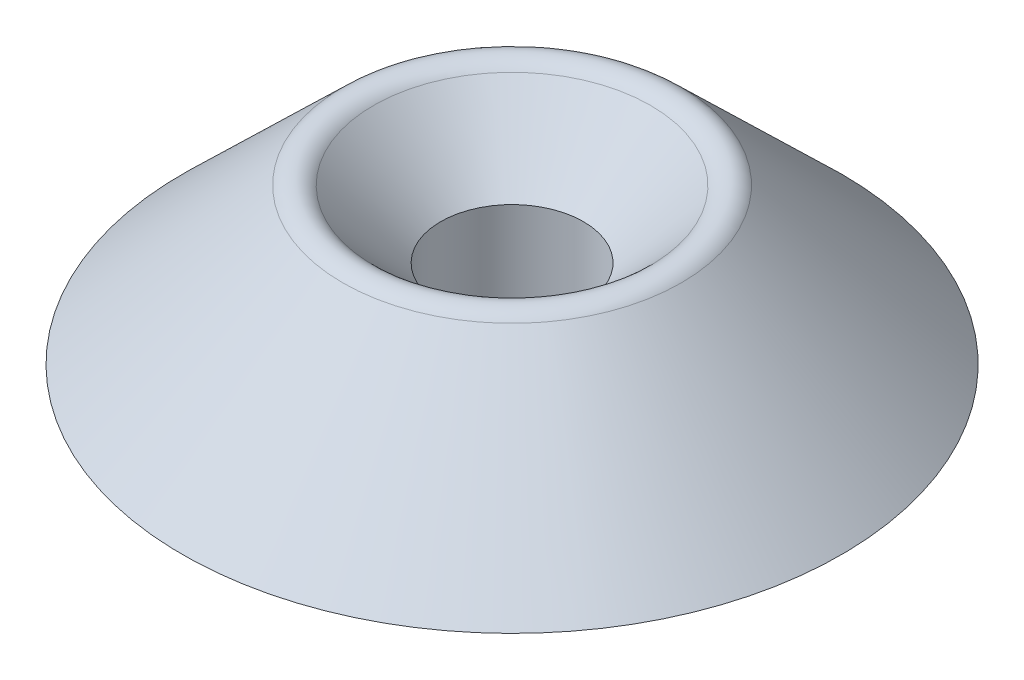
ISO-10303-21;
HEADER;
FILE_DESCRIPTION(('STEP AP214'),'2;1');
FILE_NAME('part.step','',(''),(''),'','','');
FILE_SCHEMA(('AUTOMOTIVE_DESIGN { 1 0 10303 214 1 1 1 1 }'));
ENDSEC;
DATA;
#1=APPLICATION_CONTEXT('core data for automotive mechanical design processes');
#2=APPLICATION_PROTOCOL_DEFINITION('international standard','automotive_design',2000,#1);
#3=PRODUCT_CONTEXT('',#1,'mechanical');
#4=PRODUCT('Part','Part','',(#3));
#5=PRODUCT_RELATED_PRODUCT_CATEGORY('part','',(#4));
#6=PRODUCT_DEFINITION_FORMATION('','',#4);
#7=PRODUCT_DEFINITION_CONTEXT('part definition',#1,'design');
#8=PRODUCT_DEFINITION('design','',#6,#7);
#9=PRODUCT_DEFINITION_SHAPE('','',#8);
#10=(LENGTH_UNIT() NAMED_UNIT(*) SI_UNIT(.MILLI.,.METRE.));
#11=(NAMED_UNIT(*) PLANE_ANGLE_UNIT() SI_UNIT($,.RADIAN.));
#12=(NAMED_UNIT(*) SI_UNIT($,.STERADIAN.) SOLID_ANGLE_UNIT());
#13=UNCERTAINTY_MEASURE_WITH_UNIT(LENGTH_MEASURE(1.E-05),#10,'distance_accuracy_value','');
#14=(GEOMETRIC_REPRESENTATION_CONTEXT(3) GLOBAL_UNCERTAINTY_ASSIGNED_CONTEXT((#13)) GLOBAL_UNIT_ASSIGNED_CONTEXT((#10,
#11,#12)) REPRESENTATION_CONTEXT('',''));
#15=CARTESIAN_POINT('',(0.,0.,0.));
#16=DIRECTION('',(0.,0.,1.));
#17=DIRECTION('',(1.,0.,0.));
#18=AXIS2_PLACEMENT_3D('',#15,#16,#17);
#19=CARTESIAN_POINT('',(0.,0.,0.));
#20=DIRECTION('',(0.,-1.,0.));
#21=DIRECTION('',(0.,0.,-1.));
#22=AXIS2_PLACEMENT_3D('',#19,#20,#21);
#23=CYLINDRICAL_SURFACE('',#22,3.25);
#24=CARTESIAN_POINT('',(0.,0.,0.));
#25=DIRECTION('',(0.,-1.,0.));
#26=DIRECTION('',(0.,0.,-1.));
#27=AXIS2_PLACEMENT_3D('',#24,#25,#26);
#28=CIRCLE('',#27,3.25);
#29=CARTESIAN_POINT('',(0.,0.,-3.25));
#30=VERTEX_POINT('',#29);
#31=EDGE_CURVE('E48',#30,#30,#28,.T.);
#32=ORIENTED_EDGE('',*,*,#31,.T.);
#33=EDGE_LOOP('',(#32));
#34=FACE_BOUND('',#33,.T.);
#35=CARTESIAN_POINT('',(0.,4.,0.));
#36=DIRECTION('',(0.,-1.,0.));
#37=DIRECTION('',(0.,0.,-1.));
#38=AXIS2_PLACEMENT_3D('',#35,#36,#37);
#39=CIRCLE('',#38,3.25);
#40=CARTESIAN_POINT('',(0.,4.,-3.25));
#41=VERTEX_POINT('',#40);
#42=EDGE_CURVE('E57',#41,#41,#39,.T.);
#43=ORIENTED_EDGE('',*,*,#42,.F.);
#44=EDGE_LOOP('',(#43));
#45=FACE_BOUND('',#44,.T.);
#46=ADVANCED_FACE('F37',(#34,#45),#23,.F.);
#47=CARTESIAN_POINT('',(3.25,0.,0.));
#48=DIRECTION('',(0.,-1.,0.));
#49=DIRECTION('',(0.,0.,-1.));
#50=AXIS2_PLACEMENT_3D('',#47,#48,#49);
#51=PLANE('',#50);
#52=CARTESIAN_POINT('',(0.,0.,0.));
#53=DIRECTION('',(0.,-1.,0.));
#54=DIRECTION('',(0.,0.,-1.));
#55=AXIS2_PLACEMENT_3D('',#52,#53,#54);
#56=CIRCLE('',#55,15.);
#57=CARTESIAN_POINT('',(0.,0.,-15.));
#58=VERTEX_POINT('',#57);
#59=EDGE_CURVE('E52',#58,#58,#56,.T.);
#60=ORIENTED_EDGE('',*,*,#59,.T.);
#61=EDGE_LOOP('',(#60));
#62=FACE_BOUND('',#61,.T.);
#63=ORIENTED_EDGE('',*,*,#31,.F.);
#64=EDGE_LOOP('',(#63));
#65=FACE_BOUND('',#64,.T.);
#66=ADVANCED_FACE('F64',(#62,#65),#51,.T.);
#67=CARTESIAN_POINT('',(0.,0.,0.));
#68=DIRECTION('',(0.,-1.,0.));
#69=DIRECTION('',(0.,0.,-1.));
#70=AXIS2_PLACEMENT_3D('',#67,#68,#69);
#71=CONICAL_SURFACE('',#70,15.,0.801269846389239);
#72=CARTESIAN_POINT('',(0.,7.06516150448033,0.));
#73=DIRECTION('',(0.,1.,0.));
#74=DIRECTION('',(0.,0.,1.));
#75=AXIS2_PLACEMENT_3D('',#72,#73,#74);
#76=CIRCLE('',#75,7.70693005989127);
#77=CARTESIAN_POINT('',(0.,7.06516150448033,7.70693005989127));
#78=VERTEX_POINT('',#77);
#79=EDGE_CURVE('E44',#78,#78,#76,.F.);
#80=ORIENTED_EDGE('',*,*,#79,.T.);
#81=EDGE_LOOP('',(#80));
#82=FACE_BOUND('',#81,.T.);
#83=ORIENTED_EDGE('',*,*,#59,.F.);
#84=EDGE_LOOP('',(#83));
#85=FACE_BOUND('',#84,.T.);
#86=ADVANCED_FACE('F69',(#82,#85),#71,.T.);
#87=CARTESIAN_POINT('',(0.,7.74999999999999,0.));
#88=DIRECTION('',(0.,1.,0.));
#89=DIRECTION('',(0.,0.,1.));
#90=AXIS2_PLACEMENT_3D('',#87,#88,#89);
#91=CONICAL_SURFACE('',#90,7.,0.78539816339745);
#92=CARTESIAN_POINT('',(0.,7.0540280628777,0.));
#93=DIRECTION('',(0.,-1.,0.));
#94=DIRECTION('',(0.,0.,-1.));
#95=AXIS2_PLACEMENT_3D('',#92,#93,#94);
#96=CIRCLE('',#95,6.30402806287771);
#97=CARTESIAN_POINT('',(0.,7.0540280628777,-6.30402806287771));
#98=VERTEX_POINT('',#97);
#99=EDGE_CURVE('E10',#98,#98,#96,.F.);
#100=ORIENTED_EDGE('',*,*,#99,.T.);
#101=EDGE_LOOP('',(#100));
#102=FACE_BOUND('',#101,.T.);
#103=ORIENTED_EDGE('',*,*,#42,.T.);
#104=EDGE_LOOP('',(#103));
#105=FACE_BOUND('',#104,.T.);
#106=ADVANCED_FACE('F61',(#102,#105),#91,.F.);
#107=CARTESIAN_POINT('',(0.,6.34692128169115,0.));
#108=DIRECTION('',(0.,1.,0.));
#109=DIRECTION('',(0.,0.,1.));
#110=AXIS2_PLACEMENT_3D('',#107,#108,#109);
#111=TOROIDAL_SURFACE('',#110,7.01113484406426,1.);
#112=ORIENTED_EDGE('',*,*,#99,.F.);
#113=EDGE_LOOP('',(#112));
#114=FACE_BOUND('',#113,.T.);
#115=ORIENTED_EDGE('',*,*,#79,.F.);
#116=EDGE_LOOP('',(#115));
#117=FACE_BOUND('',#116,.T.);
#118=ADVANCED_FACE('F39',(#114,#117),#111,.T.);
#119=CLOSED_SHELL('',(#46,#66,#86,#106,#118));
#120=MANIFOLD_SOLID_BREP('B2',#119);
#121=ADVANCED_BREP_SHAPE_REPRESENTATION('',(#18,#120),#14);
#122=SHAPE_DEFINITION_REPRESENTATION(#9,#121);
ENDSEC;
END-ISO-10303-21;
